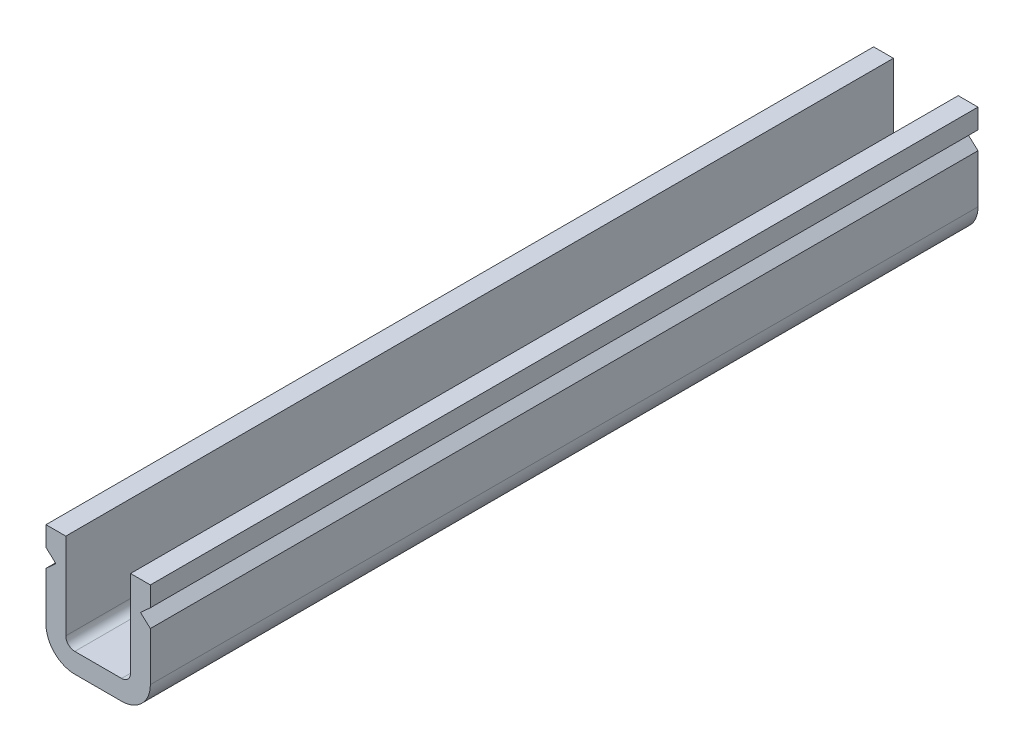
ISO-10303-21;
HEADER;
FILE_DESCRIPTION(('STEP AP214'),'2;1');
FILE_NAME('part.step','',(''),(''),'','','');
FILE_SCHEMA(('AUTOMOTIVE_DESIGN { 1 0 10303 214 1 1 1 1 }'));
ENDSEC;
DATA;
#1=APPLICATION_CONTEXT('core data for automotive mechanical design processes');
#2=APPLICATION_PROTOCOL_DEFINITION('international standard','automotive_design',2000,#1);
#3=PRODUCT_CONTEXT('',#1,'mechanical');
#4=PRODUCT('Part','Part','',(#3));
#5=PRODUCT_RELATED_PRODUCT_CATEGORY('part','',(#4));
#6=PRODUCT_DEFINITION_FORMATION('','',#4);
#7=PRODUCT_DEFINITION_CONTEXT('part definition',#1,'design');
#8=PRODUCT_DEFINITION('design','',#6,#7);
#9=PRODUCT_DEFINITION_SHAPE('','',#8);
#10=(LENGTH_UNIT() NAMED_UNIT(*) SI_UNIT(.MILLI.,.METRE.));
#11=(NAMED_UNIT(*) PLANE_ANGLE_UNIT() SI_UNIT($,.RADIAN.));
#12=(NAMED_UNIT(*) SI_UNIT($,.STERADIAN.) SOLID_ANGLE_UNIT());
#13=UNCERTAINTY_MEASURE_WITH_UNIT(LENGTH_MEASURE(1.E-05),#10,'distance_accuracy_value','');
#14=(GEOMETRIC_REPRESENTATION_CONTEXT(3) GLOBAL_UNCERTAINTY_ASSIGNED_CONTEXT((#13)) GLOBAL_UNIT_ASSIGNED_CONTEXT((#10,
#11,#12)) REPRESENTATION_CONTEXT('',''));
#15=CARTESIAN_POINT('',(0.,0.,0.));
#16=DIRECTION('',(0.,0.,1.));
#17=DIRECTION('',(1.,0.,0.));
#18=AXIS2_PLACEMENT_3D('',#15,#16,#17);
#19=CARTESIAN_POINT('',(1.09999999999999,0.,46.));
#20=DIRECTION('',(0.,-1.,0.));
#21=DIRECTION('',(1.,0.,0.));
#22=AXIS2_PLACEMENT_3D('',#19,#20,#21);
#23=PLANE('',#22);
#24=DIRECTION('',(-1.,0.,0.));
#25=VECTOR('',#24,1.);
#26=CARTESIAN_POINT('',(1.09999999999999,0.,0.));
#27=LINE('',#26,#25);
#28=CARTESIAN_POINT('',(1.09999999999999,0.,0.));
#29=VERTEX_POINT('',#28);
#30=CARTESIAN_POINT('',(0.,0.,0.));
#31=VERTEX_POINT('',#30);
#32=EDGE_CURVE('E189',#29,#31,#27,.T.);
#33=ORIENTED_EDGE('',*,*,#32,.T.);
#34=DIRECTION('',(0.,0.,-1.));
#35=VECTOR('',#34,1.);
#36=CARTESIAN_POINT('',(0.,0.,46.));
#37=LINE('',#36,#35);
#38=CARTESIAN_POINT('',(0.,0.,46.));
#39=VERTEX_POINT('',#38);
#40=EDGE_CURVE('E11',#39,#31,#37,.T.);
#41=ORIENTED_EDGE('',*,*,#40,.F.);
#42=DIRECTION('',(-1.,0.,0.));
#43=VECTOR('',#42,1.);
#44=CARTESIAN_POINT('',(1.09999999999999,0.,46.));
#45=LINE('',#44,#43);
#46=CARTESIAN_POINT('',(1.09999999999999,0.,46.));
#47=VERTEX_POINT('',#46);
#48=EDGE_CURVE('E223',#47,#39,#45,.T.);
#49=ORIENTED_EDGE('',*,*,#48,.F.);
#50=DIRECTION('',(0.,0.,-1.));
#51=VECTOR('',#50,1.);
#52=CARTESIAN_POINT('',(1.09999999999999,0.,46.));
#53=LINE('',#52,#51);
#54=EDGE_CURVE('E185',#47,#29,#53,.T.);
#55=ORIENTED_EDGE('',*,*,#54,.T.);
#56=EDGE_LOOP('',(#33,#41,#49,#55));
#57=FACE_BOUND('',#56,.T.);
#58=ADVANCED_FACE('F33',(#57),#23,.F.);
#59=CARTESIAN_POINT('',(0.,0.,46.));
#60=DIRECTION('',(1.,0.,0.));
#61=DIRECTION('',(0.,0.,-1.));
#62=AXIS2_PLACEMENT_3D('',#59,#60,#61);
#63=PLANE('',#62);
#64=DIRECTION('',(0.,-1.,0.));
#65=VECTOR('',#64,1.);
#66=CARTESIAN_POINT('',(0.,0.,0.));
#67=LINE('',#66,#65);
#68=CARTESIAN_POINT('',(0.,-1.1,0.));
#69=VERTEX_POINT('',#68);
#70=EDGE_CURVE('E192',#31,#69,#67,.T.);
#71=ORIENTED_EDGE('',*,*,#70,.T.);
#72=DIRECTION('',(0.,0.,-1.));
#73=VECTOR('',#72,1.);
#74=CARTESIAN_POINT('',(0.,-1.1,46.));
#75=LINE('',#74,#73);
#76=CARTESIAN_POINT('',(0.,-1.1,46.));
#77=VERTEX_POINT('',#76);
#78=EDGE_CURVE('E41',#77,#69,#75,.T.);
#79=ORIENTED_EDGE('',*,*,#78,.F.);
#80=DIRECTION('',(0.,-1.,0.));
#81=VECTOR('',#80,1.);
#82=CARTESIAN_POINT('',(0.,0.,46.));
#83=LINE('',#82,#81);
#84=EDGE_CURVE('E122',#39,#77,#83,.T.);
#85=ORIENTED_EDGE('',*,*,#84,.F.);
#86=ORIENTED_EDGE('',*,*,#40,.T.);
#87=EDGE_LOOP('',(#71,#79,#85,#86));
#88=FACE_BOUND('',#87,.T.);
#89=ADVANCED_FACE('F331',(#88),#63,.F.);
#90=CARTESIAN_POINT('',(0.,-1.1,46.));
#91=DIRECTION('',(0.672672793996313,0.739940073395944,0.));
#92=DIRECTION('',(-0.739940073395944,0.672672793996313,0.));
#93=AXIS2_PLACEMENT_3D('',#90,#91,#92);
#94=PLANE('',#93);
#95=DIRECTION('',(0.739940073395943,-0.672672793996313,0.));
#96=VECTOR('',#95,1.);
#97=CARTESIAN_POINT('',(0.,-1.1,0.));
#98=LINE('',#97,#96);
#99=CARTESIAN_POINT('',(0.549999999999995,-1.6,0.));
#100=VERTEX_POINT('',#99);
#101=EDGE_CURVE('E194',#69,#100,#98,.T.);
#102=ORIENTED_EDGE('',*,*,#101,.T.);
#103=DIRECTION('',(0.,0.,-1.));
#104=VECTOR('',#103,1.);
#105=CARTESIAN_POINT('',(0.549999999999995,-1.6,46.));
#106=LINE('',#105,#104);
#107=CARTESIAN_POINT('',(0.549999999999995,-1.6,46.));
#108=VERTEX_POINT('',#107);
#109=EDGE_CURVE('E260',#108,#100,#106,.T.);
#110=ORIENTED_EDGE('',*,*,#109,.F.);
#111=DIRECTION('',(0.739940073395943,-0.672672793996313,0.));
#112=VECTOR('',#111,1.);
#113=CARTESIAN_POINT('',(0.,-1.1,46.));
#114=LINE('',#113,#112);
#115=EDGE_CURVE('E268',#77,#108,#114,.T.);
#116=ORIENTED_EDGE('',*,*,#115,.F.);
#117=ORIENTED_EDGE('',*,*,#78,.T.);
#118=EDGE_LOOP('',(#102,#110,#116,#117));
#119=FACE_BOUND('',#118,.T.);
#120=ADVANCED_FACE('F266',(#119),#94,.F.);
#121=CARTESIAN_POINT('',(0.,-2.1,46.));
#122=DIRECTION('',(0.672672793996316,-0.739940073395941,0.));
#123=DIRECTION('',(0.739940073395941,0.672672793996316,0.));
#124=AXIS2_PLACEMENT_3D('',#121,#122,#123);
#125=PLANE('',#124);
#126=DIRECTION('',(-0.739940073395941,-0.672672793996316,0.));
#127=VECTOR('',#126,1.);
#128=CARTESIAN_POINT('',(0.,-2.1,0.));
#129=LINE('',#128,#127);
#130=CARTESIAN_POINT('',(0.,-2.1,0.));
#131=VERTEX_POINT('',#130);
#132=EDGE_CURVE('E196',#100,#131,#129,.T.);
#133=ORIENTED_EDGE('',*,*,#132,.T.);
#134=DIRECTION('',(0.,0.,-1.));
#135=VECTOR('',#134,1.);
#136=CARTESIAN_POINT('',(0.,-2.1,46.));
#137=LINE('',#136,#135);
#138=CARTESIAN_POINT('',(0.,-2.1,46.));
#139=VERTEX_POINT('',#138);
#140=EDGE_CURVE('E257',#139,#131,#137,.T.);
#141=ORIENTED_EDGE('',*,*,#140,.F.);
#142=DIRECTION('',(-0.739940073395941,-0.672672793996316,0.));
#143=VECTOR('',#142,1.);
#144=CARTESIAN_POINT('',(0.,-2.1,46.));
#145=LINE('',#144,#143);
#146=EDGE_CURVE('E286',#108,#139,#145,.T.);
#147=ORIENTED_EDGE('',*,*,#146,.F.);
#148=ORIENTED_EDGE('',*,*,#109,.T.);
#149=EDGE_LOOP('',(#133,#141,#147,#148));
#150=FACE_BOUND('',#149,.T.);
#151=ADVANCED_FACE('F277',(#150),#125,.F.);
#152=CARTESIAN_POINT('',(0.,-2.1,46.));
#153=DIRECTION('',(1.,0.,0.));
#154=DIRECTION('',(0.,1.,0.));
#155=AXIS2_PLACEMENT_3D('',#152,#153,#154);
#156=PLANE('',#155);
#157=DIRECTION('',(0.,-1.,0.));
#158=VECTOR('',#157,1.);
#159=CARTESIAN_POINT('',(0.,-2.1,0.));
#160=LINE('',#159,#158);
#161=CARTESIAN_POINT('',(0.,-4.79999999999998,0.));
#162=VERTEX_POINT('',#161);
#163=EDGE_CURVE('E198',#131,#162,#160,.T.);
#164=ORIENTED_EDGE('',*,*,#163,.T.);
#165=DIRECTION('',(0.,0.,-1.));
#166=VECTOR('',#165,1.);
#167=CARTESIAN_POINT('',(0.,-4.79999999999998,46.));
#168=LINE('',#167,#166);
#169=CARTESIAN_POINT('',(0.,-4.79999999999998,46.));
#170=VERTEX_POINT('',#169);
#171=EDGE_CURVE('E254',#170,#162,#168,.T.);
#172=ORIENTED_EDGE('',*,*,#171,.F.);
#173=DIRECTION('',(0.,-1.,0.));
#174=VECTOR('',#173,1.);
#175=CARTESIAN_POINT('',(0.,-2.1,46.));
#176=LINE('',#175,#174);
#177=EDGE_CURVE('E283',#139,#170,#176,.T.);
#178=ORIENTED_EDGE('',*,*,#177,.F.);
#179=ORIENTED_EDGE('',*,*,#140,.T.);
#180=EDGE_LOOP('',(#164,#172,#178,#179));
#181=FACE_BOUND('',#180,.T.);
#182=ADVANCED_FACE('F281',(#181),#156,.F.);
#183=CARTESIAN_POINT('',(1.6,-4.79999999999998,46.));
#184=DIRECTION('',(0.,0.,-1.));
#185=DIRECTION('',(-1.,0.,0.));
#186=AXIS2_PLACEMENT_3D('',#183,#184,#185);
#187=CYLINDRICAL_SURFACE('',#186,1.6);
#188=CARTESIAN_POINT('',(1.6,-4.79999999999998,0.));
#189=DIRECTION('',(0.,0.,1.));
#190=DIRECTION('',(1.,0.,0.));
#191=AXIS2_PLACEMENT_3D('',#188,#189,#190);
#192=CIRCLE('',#191,1.6);
#193=CARTESIAN_POINT('',(1.6,-6.39999999999998,0.));
#194=VERTEX_POINT('',#193);
#195=EDGE_CURVE('E200',#162,#194,#192,.T.);
#196=ORIENTED_EDGE('',*,*,#195,.T.);
#197=DIRECTION('',(0.,0.,-1.));
#198=VECTOR('',#197,1.);
#199=CARTESIAN_POINT('',(1.6,-6.39999999999998,46.));
#200=LINE('',#199,#198);
#201=CARTESIAN_POINT('',(1.6,-6.39999999999998,46.));
#202=VERTEX_POINT('',#201);
#203=EDGE_CURVE('E251',#202,#194,#200,.T.);
#204=ORIENTED_EDGE('',*,*,#203,.F.);
#205=CARTESIAN_POINT('',(1.6,-4.79999999999998,46.));
#206=DIRECTION('',(0.,0.,1.));
#207=DIRECTION('',(1.,0.,0.));
#208=AXIS2_PLACEMENT_3D('',#205,#206,#207);
#209=CIRCLE('',#208,1.6);
#210=EDGE_CURVE('E285',#170,#202,#209,.T.);
#211=ORIENTED_EDGE('',*,*,#210,.F.);
#212=ORIENTED_EDGE('',*,*,#171,.T.);
#213=EDGE_LOOP('',(#196,#204,#211,#212));
#214=FACE_BOUND('',#213,.T.);
#215=ADVANCED_FACE('F344',(#214),#187,.T.);
#216=CARTESIAN_POINT('',(1.6,-6.39999999999998,46.));
#217=DIRECTION('',(0.,1.,0.));
#218=DIRECTION('',(0.,0.,1.));
#219=AXIS2_PLACEMENT_3D('',#216,#217,#218);
#220=PLANE('',#219);
#221=DIRECTION('',(1.,0.,0.));
#222=VECTOR('',#221,1.);
#223=CARTESIAN_POINT('',(1.6,-6.39999999999998,0.));
#224=LINE('',#223,#222);
#225=CARTESIAN_POINT('',(4.19999999999997,-6.39999999999998,0.));
#226=VERTEX_POINT('',#225);
#227=EDGE_CURVE('E202',#194,#226,#224,.T.);
#228=ORIENTED_EDGE('',*,*,#227,.T.);
#229=DIRECTION('',(0.,0.,-1.));
#230=VECTOR('',#229,1.);
#231=CARTESIAN_POINT('',(4.19999999999997,-6.39999999999998,46.));
#232=LINE('',#231,#230);
#233=CARTESIAN_POINT('',(4.19999999999997,-6.39999999999998,46.));
#234=VERTEX_POINT('',#233);
#235=EDGE_CURVE('E248',#234,#226,#232,.T.);
#236=ORIENTED_EDGE('',*,*,#235,.F.);
#237=DIRECTION('',(1.,0.,0.));
#238=VECTOR('',#237,1.);
#239=CARTESIAN_POINT('',(1.6,-6.39999999999998,46.));
#240=LINE('',#239,#238);
#241=EDGE_CURVE('E288',#202,#234,#240,.T.);
#242=ORIENTED_EDGE('',*,*,#241,.F.);
#243=ORIENTED_EDGE('',*,*,#203,.T.);
#244=EDGE_LOOP('',(#228,#236,#242,#243));
#245=FACE_BOUND('',#244,.T.);
#246=ADVANCED_FACE('F347',(#245),#220,.F.);
#247=CARTESIAN_POINT('',(4.19999999999997,-4.79999999999998,46.));
#248=DIRECTION('',(0.,0.,-1.));
#249=DIRECTION('',(-1.,0.,0.));
#250=AXIS2_PLACEMENT_3D('',#247,#248,#249);
#251=CYLINDRICAL_SURFACE('',#250,1.6);
#252=CARTESIAN_POINT('',(4.19999999999997,-4.79999999999998,0.));
#253=DIRECTION('',(0.,0.,1.));
#254=DIRECTION('',(1.,0.,0.));
#255=AXIS2_PLACEMENT_3D('',#252,#253,#254);
#256=CIRCLE('',#255,1.6);
#257=CARTESIAN_POINT('',(5.79999999999997,-4.79999999999998,0.));
#258=VERTEX_POINT('',#257);
#259=EDGE_CURVE('E204',#226,#258,#256,.T.);
#260=ORIENTED_EDGE('',*,*,#259,.T.);
#261=DIRECTION('',(0.,0.,-1.));
#262=VECTOR('',#261,1.);
#263=CARTESIAN_POINT('',(5.79999999999997,-4.79999999999998,46.));
#264=LINE('',#263,#262);
#265=CARTESIAN_POINT('',(5.79999999999997,-4.79999999999998,46.));
#266=VERTEX_POINT('',#265);
#267=EDGE_CURVE('E245',#266,#258,#264,.T.);
#268=ORIENTED_EDGE('',*,*,#267,.F.);
#269=CARTESIAN_POINT('',(4.19999999999997,-4.79999999999998,46.));
#270=DIRECTION('',(0.,0.,1.));
#271=DIRECTION('',(1.,0.,0.));
#272=AXIS2_PLACEMENT_3D('',#269,#270,#271);
#273=CIRCLE('',#272,1.6);
#274=EDGE_CURVE('E294',#234,#266,#273,.T.);
#275=ORIENTED_EDGE('',*,*,#274,.F.);
#276=ORIENTED_EDGE('',*,*,#235,.T.);
#277=EDGE_LOOP('',(#260,#268,#275,#276));
#278=FACE_BOUND('',#277,.T.);
#279=ADVANCED_FACE('F351',(#278),#251,.T.);
#280=CARTESIAN_POINT('',(5.79999999999998,-4.79999999999998,46.));
#281=DIRECTION('',(-1.,0.,0.));
#282=DIRECTION('',(0.,-1.,0.));
#283=AXIS2_PLACEMENT_3D('',#280,#281,#282);
#284=PLANE('',#283);
#285=DIRECTION('',(0.,1.,0.));
#286=VECTOR('',#285,1.);
#287=CARTESIAN_POINT('',(5.79999999999998,-4.79999999999998,0.));
#288=LINE('',#287,#286);
#289=CARTESIAN_POINT('',(5.79999999999997,-2.1,0.));
#290=VERTEX_POINT('',#289);
#291=EDGE_CURVE('E206',#258,#290,#288,.T.);
#292=ORIENTED_EDGE('',*,*,#291,.T.);
#293=DIRECTION('',(0.,0.,-1.));
#294=VECTOR('',#293,1.);
#295=CARTESIAN_POINT('',(5.79999999999997,-2.1,46.));
#296=LINE('',#295,#294);
#297=CARTESIAN_POINT('',(5.79999999999997,-2.1,46.));
#298=VERTEX_POINT('',#297);
#299=EDGE_CURVE('E242',#298,#290,#296,.T.);
#300=ORIENTED_EDGE('',*,*,#299,.F.);
#301=DIRECTION('',(0.,1.,0.));
#302=VECTOR('',#301,1.);
#303=CARTESIAN_POINT('',(5.79999999999998,-4.79999999999998,46.));
#304=LINE('',#303,#302);
#305=EDGE_CURVE('E296',#266,#298,#304,.T.);
#306=ORIENTED_EDGE('',*,*,#305,.F.);
#307=ORIENTED_EDGE('',*,*,#267,.T.);
#308=EDGE_LOOP('',(#292,#300,#306,#307));
#309=FACE_BOUND('',#308,.T.);
#310=ADVANCED_FACE('F355',(#309),#284,.F.);
#311=CARTESIAN_POINT('',(5.79999999999997,-2.1,46.));
#312=DIRECTION('',(-0.672672793996319,-0.739940073395937,0.));
#313=DIRECTION('',(0.739940073395937,-0.672672793996319,0.));
#314=AXIS2_PLACEMENT_3D('',#311,#312,#313);
#315=PLANE('',#314);
#316=DIRECTION('',(-0.739940073395937,0.672672793996319,0.));
#317=VECTOR('',#316,1.);
#318=CARTESIAN_POINT('',(5.79999999999997,-2.1,0.));
#319=LINE('',#318,#317);
#320=CARTESIAN_POINT('',(5.24999999999999,-1.6,0.));
#321=VERTEX_POINT('',#320);
#322=EDGE_CURVE('E208',#290,#321,#319,.T.);
#323=ORIENTED_EDGE('',*,*,#322,.T.);
#324=DIRECTION('',(0.,0.,-1.));
#325=VECTOR('',#324,1.);
#326=CARTESIAN_POINT('',(5.24999999999999,-1.6,46.));
#327=LINE('',#326,#325);
#328=CARTESIAN_POINT('',(5.24999999999999,-1.6,46.));
#329=VERTEX_POINT('',#328);
#330=EDGE_CURVE('E239',#329,#321,#327,.T.);
#331=ORIENTED_EDGE('',*,*,#330,.F.);
#332=DIRECTION('',(-0.739940073395937,0.672672793996319,0.));
#333=VECTOR('',#332,1.);
#334=CARTESIAN_POINT('',(5.79999999999997,-2.1,46.));
#335=LINE('',#334,#333);
#336=EDGE_CURVE('E298',#298,#329,#335,.T.);
#337=ORIENTED_EDGE('',*,*,#336,.F.);
#338=ORIENTED_EDGE('',*,*,#299,.T.);
#339=EDGE_LOOP('',(#323,#331,#337,#338));
#340=FACE_BOUND('',#339,.T.);
#341=ADVANCED_FACE('F359',(#340),#315,.F.);
#342=CARTESIAN_POINT('',(5.79999999999997,-1.1,46.));
#343=DIRECTION('',(-0.672672793996316,0.73994007339594,0.));
#344=DIRECTION('',(-0.73994007339594,-0.672672793996317,0.));
#345=AXIS2_PLACEMENT_3D('',#342,#343,#344);
#346=PLANE('',#345);
#347=DIRECTION('',(0.73994007339594,0.672672793996317,0.));
#348=VECTOR('',#347,1.);
#349=CARTESIAN_POINT('',(5.79999999999997,-1.1,0.));
#350=LINE('',#349,#348);
#351=CARTESIAN_POINT('',(5.79999999999997,-1.1,0.));
#352=VERTEX_POINT('',#351);
#353=EDGE_CURVE('E210',#321,#352,#350,.T.);
#354=ORIENTED_EDGE('',*,*,#353,.T.);
#355=DIRECTION('',(0.,0.,-1.));
#356=VECTOR('',#355,1.);
#357=CARTESIAN_POINT('',(5.79999999999997,-1.1,46.));
#358=LINE('',#357,#356);
#359=CARTESIAN_POINT('',(5.79999999999997,-1.1,46.));
#360=VERTEX_POINT('',#359);
#361=EDGE_CURVE('E236',#360,#352,#358,.T.);
#362=ORIENTED_EDGE('',*,*,#361,.F.);
#363=DIRECTION('',(0.73994007339594,0.672672793996317,0.));
#364=VECTOR('',#363,1.);
#365=CARTESIAN_POINT('',(5.79999999999997,-1.1,46.));
#366=LINE('',#365,#364);
#367=EDGE_CURVE('E300',#329,#360,#366,.T.);
#368=ORIENTED_EDGE('',*,*,#367,.F.);
#369=ORIENTED_EDGE('',*,*,#330,.T.);
#370=EDGE_LOOP('',(#354,#362,#368,#369));
#371=FACE_BOUND('',#370,.T.);
#372=ADVANCED_FACE('F363',(#371),#346,.F.);
#373=CARTESIAN_POINT('',(5.79999999999997,-1.1,46.));
#374=DIRECTION('',(-1.,0.,0.));
#375=DIRECTION('',(0.,0.,1.));
#376=AXIS2_PLACEMENT_3D('',#373,#374,#375);
#377=PLANE('',#376);
#378=DIRECTION('',(0.,1.,0.));
#379=VECTOR('',#378,1.);
#380=CARTESIAN_POINT('',(5.79999999999997,-1.1,0.));
#381=LINE('',#380,#379);
#382=CARTESIAN_POINT('',(5.79999999999997,0.,0.));
#383=VERTEX_POINT('',#382);
#384=EDGE_CURVE('E212',#352,#383,#381,.T.);
#385=ORIENTED_EDGE('',*,*,#384,.T.);
#386=DIRECTION('',(0.,0.,-1.));
#387=VECTOR('',#386,1.);
#388=CARTESIAN_POINT('',(5.79999999999997,0.,46.));
#389=LINE('',#388,#387);
#390=CARTESIAN_POINT('',(5.79999999999997,0.,46.));
#391=VERTEX_POINT('',#390);
#392=EDGE_CURVE('E233',#391,#383,#389,.T.);
#393=ORIENTED_EDGE('',*,*,#392,.F.);
#394=DIRECTION('',(0.,1.,0.));
#395=VECTOR('',#394,1.);
#396=CARTESIAN_POINT('',(5.79999999999997,-1.1,46.));
#397=LINE('',#396,#395);
#398=EDGE_CURVE('E302',#360,#391,#397,.T.);
#399=ORIENTED_EDGE('',*,*,#398,.F.);
#400=ORIENTED_EDGE('',*,*,#361,.T.);
#401=EDGE_LOOP('',(#385,#393,#399,#400));
#402=FACE_BOUND('',#401,.T.);
#403=ADVANCED_FACE('F367',(#402),#377,.F.);
#404=CARTESIAN_POINT('',(5.79999999999997,0.,46.));
#405=DIRECTION('',(0.,-1.,0.));
#406=DIRECTION('',(1.,0.,0.));
#407=AXIS2_PLACEMENT_3D('',#404,#405,#406);
#408=PLANE('',#407);
#409=DIRECTION('',(-1.,0.,0.));
#410=VECTOR('',#409,1.);
#411=CARTESIAN_POINT('',(5.79999999999997,0.,0.));
#412=LINE('',#411,#410);
#413=CARTESIAN_POINT('',(4.69999999999999,0.,0.));
#414=VERTEX_POINT('',#413);
#415=EDGE_CURVE('E214',#383,#414,#412,.T.);
#416=ORIENTED_EDGE('',*,*,#415,.T.);
#417=DIRECTION('',(0.,0.,-1.));
#418=VECTOR('',#417,1.);
#419=CARTESIAN_POINT('',(4.69999999999999,0.,46.));
#420=LINE('',#419,#418);
#421=CARTESIAN_POINT('',(4.69999999999999,0.,46.));
#422=VERTEX_POINT('',#421);
#423=EDGE_CURVE('E230',#422,#414,#420,.T.);
#424=ORIENTED_EDGE('',*,*,#423,.F.);
#425=DIRECTION('',(-1.,0.,0.));
#426=VECTOR('',#425,1.);
#427=CARTESIAN_POINT('',(5.79999999999997,0.,46.));
#428=LINE('',#427,#426);
#429=EDGE_CURVE('E304',#391,#422,#428,.T.);
#430=ORIENTED_EDGE('',*,*,#429,.F.);
#431=ORIENTED_EDGE('',*,*,#392,.T.);
#432=EDGE_LOOP('',(#416,#424,#430,#431));
#433=FACE_BOUND('',#432,.T.);
#434=ADVANCED_FACE('F371',(#433),#408,.F.);
#435=CARTESIAN_POINT('',(4.69999999999999,-4.8,46.));
#436=DIRECTION('',(1.,0.,0.));
#437=DIRECTION('',(0.,0.,-1.));
#438=AXIS2_PLACEMENT_3D('',#435,#436,#437);
#439=PLANE('',#438);
#440=DIRECTION('',(0.,-1.,0.));
#441=VECTOR('',#440,1.);
#442=CARTESIAN_POINT('',(4.69999999999999,-4.8,0.));
#443=LINE('',#442,#441);
#444=CARTESIAN_POINT('',(4.69999999999999,-4.8,0.));
#445=VERTEX_POINT('',#444);
#446=EDGE_CURVE('E216',#414,#445,#443,.T.);
#447=ORIENTED_EDGE('',*,*,#446,.T.);
#448=DIRECTION('',(0.,0.,-1.));
#449=VECTOR('',#448,1.);
#450=CARTESIAN_POINT('',(4.69999999999999,-4.8,46.));
#451=LINE('',#450,#449);
#452=CARTESIAN_POINT('',(4.69999999999999,-4.8,46.));
#453=VERTEX_POINT('',#452);
#454=EDGE_CURVE('E227',#453,#445,#451,.T.);
#455=ORIENTED_EDGE('',*,*,#454,.F.);
#456=DIRECTION('',(0.,-1.,0.));
#457=VECTOR('',#456,1.);
#458=CARTESIAN_POINT('',(4.69999999999999,-4.8,46.));
#459=LINE('',#458,#457);
#460=EDGE_CURVE('E306',#422,#453,#459,.T.);
#461=ORIENTED_EDGE('',*,*,#460,.F.);
#462=ORIENTED_EDGE('',*,*,#423,.T.);
#463=EDGE_LOOP('',(#447,#455,#461,#462));
#464=FACE_BOUND('',#463,.T.);
#465=ADVANCED_FACE('F312',(#464),#439,.F.);
#466=CARTESIAN_POINT('',(4.19999999999999,-4.8,46.));
#467=DIRECTION('',(0.,0.,-1.));
#468=DIRECTION('',(-1.,0.,0.));
#469=AXIS2_PLACEMENT_3D('',#466,#467,#468);
#470=CYLINDRICAL_SURFACE('',#469,0.5);
#471=CARTESIAN_POINT('',(4.19999999999999,-4.8,0.));
#472=DIRECTION('',(0.,0.,-1.));
#473=DIRECTION('',(-1.,0.,0.));
#474=AXIS2_PLACEMENT_3D('',#471,#472,#473);
#475=CIRCLE('',#474,0.5);
#476=CARTESIAN_POINT('',(4.19999999999999,-5.3,0.));
#477=VERTEX_POINT('',#476);
#478=EDGE_CURVE('E218',#445,#477,#475,.T.);
#479=ORIENTED_EDGE('',*,*,#478,.T.);
#480=DIRECTION('',(0.,0.,-1.));
#481=VECTOR('',#480,1.);
#482=CARTESIAN_POINT('',(4.19999999999999,-5.3,46.));
#483=LINE('',#482,#481);
#484=CARTESIAN_POINT('',(4.19999999999999,-5.3,46.));
#485=VERTEX_POINT('',#484);
#486=EDGE_CURVE('E180',#485,#477,#483,.T.);
#487=ORIENTED_EDGE('',*,*,#486,.F.);
#488=CARTESIAN_POINT('',(4.19999999999999,-4.8,46.));
#489=DIRECTION('',(0.,0.,-1.));
#490=DIRECTION('',(-1.,0.,0.));
#491=AXIS2_PLACEMENT_3D('',#488,#489,#490);
#492=CIRCLE('',#491,0.5);
#493=EDGE_CURVE('E171',#453,#485,#492,.T.);
#494=ORIENTED_EDGE('',*,*,#493,.F.);
#495=ORIENTED_EDGE('',*,*,#454,.T.);
#496=EDGE_LOOP('',(#479,#487,#494,#495));
#497=FACE_BOUND('',#496,.T.);
#498=ADVANCED_FACE('F316',(#497),#470,.F.);
#499=CARTESIAN_POINT('',(1.59999999999999,-5.3,46.));
#500=DIRECTION('',(0.,-1.,0.));
#501=DIRECTION('',(0.,0.,-1.));
#502=AXIS2_PLACEMENT_3D('',#499,#500,#501);
#503=PLANE('',#502);
#504=DIRECTION('',(-1.,0.,0.));
#505=VECTOR('',#504,1.);
#506=CARTESIAN_POINT('',(1.59999999999999,-5.3,0.));
#507=LINE('',#506,#505);
#508=CARTESIAN_POINT('',(1.59999999999999,-5.3,0.));
#509=VERTEX_POINT('',#508);
#510=EDGE_CURVE('E179',#477,#509,#507,.T.);
#511=ORIENTED_EDGE('',*,*,#510,.T.);
#512=DIRECTION('',(0.,0.,-1.));
#513=VECTOR('',#512,1.);
#514=CARTESIAN_POINT('',(1.59999999999999,-5.3,46.));
#515=LINE('',#514,#513);
#516=CARTESIAN_POINT('',(1.59999999999999,-5.3,46.));
#517=VERTEX_POINT('',#516);
#518=EDGE_CURVE('E176',#517,#509,#515,.T.);
#519=ORIENTED_EDGE('',*,*,#518,.F.);
#520=DIRECTION('',(-1.,0.,0.));
#521=VECTOR('',#520,1.);
#522=CARTESIAN_POINT('',(1.59999999999999,-5.3,46.));
#523=LINE('',#522,#521);
#524=EDGE_CURVE('E165',#485,#517,#523,.T.);
#525=ORIENTED_EDGE('',*,*,#524,.F.);
#526=ORIENTED_EDGE('',*,*,#486,.T.);
#527=EDGE_LOOP('',(#511,#519,#525,#526));
#528=FACE_BOUND('',#527,.T.);
#529=ADVANCED_FACE('F177',(#528),#503,.F.);
#530=CARTESIAN_POINT('',(1.59999999999999,-4.8,46.));
#531=DIRECTION('',(0.,0.,-1.));
#532=DIRECTION('',(-1.,0.,0.));
#533=AXIS2_PLACEMENT_3D('',#530,#531,#532);
#534=CYLINDRICAL_SURFACE('',#533,0.5);
#535=CARTESIAN_POINT('',(1.59999999999999,-4.8,0.));
#536=DIRECTION('',(0.,0.,-1.));
#537=DIRECTION('',(1.,0.,0.));
#538=AXIS2_PLACEMENT_3D('',#535,#536,#537);
#539=CIRCLE('',#538,0.5);
#540=CARTESIAN_POINT('',(1.09999999999999,-4.8,0.));
#541=VERTEX_POINT('',#540);
#542=EDGE_CURVE('E108',#509,#541,#539,.T.);
#543=ORIENTED_EDGE('',*,*,#542,.T.);
#544=DIRECTION('',(0.,0.,-1.));
#545=VECTOR('',#544,1.);
#546=CARTESIAN_POINT('',(1.09999999999999,-4.8,46.));
#547=LINE('',#546,#545);
#548=CARTESIAN_POINT('',(1.09999999999999,-4.8,46.));
#549=VERTEX_POINT('',#548);
#550=EDGE_CURVE('E181',#549,#541,#547,.T.);
#551=ORIENTED_EDGE('',*,*,#550,.F.);
#552=CARTESIAN_POINT('',(1.59999999999999,-4.8,46.));
#553=DIRECTION('',(0.,0.,-1.));
#554=DIRECTION('',(1.,0.,0.));
#555=AXIS2_PLACEMENT_3D('',#552,#553,#554);
#556=CIRCLE('',#555,0.5);
#557=EDGE_CURVE('E169',#517,#549,#556,.T.);
#558=ORIENTED_EDGE('',*,*,#557,.F.);
#559=ORIENTED_EDGE('',*,*,#518,.T.);
#560=EDGE_LOOP('',(#543,#551,#558,#559));
#561=FACE_BOUND('',#560,.T.);
#562=ADVANCED_FACE('F183',(#561),#534,.F.);
#563=CARTESIAN_POINT('',(1.09999999999999,0.,46.));
#564=DIRECTION('',(-1.,0.,0.));
#565=DIRECTION('',(0.,-1.,0.));
#566=AXIS2_PLACEMENT_3D('',#563,#564,#565);
#567=PLANE('',#566);
#568=DIRECTION('',(0.,1.,0.));
#569=VECTOR('',#568,1.);
#570=CARTESIAN_POINT('',(1.09999999999999,0.,0.));
#571=LINE('',#570,#569);
#572=EDGE_CURVE('E114',#541,#29,#571,.T.);
#573=ORIENTED_EDGE('',*,*,#572,.T.);
#574=ORIENTED_EDGE('',*,*,#54,.F.);
#575=DIRECTION('',(0.,1.,0.));
#576=VECTOR('',#575,1.);
#577=CARTESIAN_POINT('',(1.09999999999999,0.,46.));
#578=LINE('',#577,#576);
#579=EDGE_CURVE('E49',#549,#47,#578,.T.);
#580=ORIENTED_EDGE('',*,*,#579,.F.);
#581=ORIENTED_EDGE('',*,*,#550,.T.);
#582=EDGE_LOOP('',(#573,#574,#580,#581));
#583=FACE_BOUND('',#582,.T.);
#584=ADVANCED_FACE('F320',(#583),#567,.F.);
#585=CARTESIAN_POINT('',(1.6,-4.79999999999998,46.));
#586=DIRECTION('',(0.,0.,1.));
#587=DIRECTION('',(1.,0.,0.));
#588=AXIS2_PLACEMENT_3D('',#585,#586,#587);
#589=PLANE('',#588);
#590=ORIENTED_EDGE('',*,*,#48,.T.);
#591=ORIENTED_EDGE('',*,*,#84,.T.);
#592=ORIENTED_EDGE('',*,*,#115,.T.);
#593=ORIENTED_EDGE('',*,*,#146,.T.);
#594=ORIENTED_EDGE('',*,*,#177,.T.);
#595=ORIENTED_EDGE('',*,*,#210,.T.);
#596=ORIENTED_EDGE('',*,*,#241,.T.);
#597=ORIENTED_EDGE('',*,*,#274,.T.);
#598=ORIENTED_EDGE('',*,*,#305,.T.);
#599=ORIENTED_EDGE('',*,*,#336,.T.);
#600=ORIENTED_EDGE('',*,*,#367,.T.);
#601=ORIENTED_EDGE('',*,*,#398,.T.);
#602=ORIENTED_EDGE('',*,*,#429,.T.);
#603=ORIENTED_EDGE('',*,*,#460,.T.);
#604=ORIENTED_EDGE('',*,*,#493,.T.);
#605=ORIENTED_EDGE('',*,*,#524,.T.);
#606=ORIENTED_EDGE('',*,*,#557,.T.);
#607=ORIENTED_EDGE('',*,*,#579,.T.);
#608=EDGE_LOOP('',(#590,#591,#592,#593,#594,#595,#596,#597,#598,#599,#600,#601,#602,#603,#604,
#605,#606,#607));
#609=FACE_BOUND('',#608,.T.);
#610=ADVANCED_FACE('F167',(#609),#589,.T.);
#611=CARTESIAN_POINT('',(1.6,-4.79999999999998,0.));
#612=DIRECTION('',(0.,0.,1.));
#613=DIRECTION('',(1.,0.,0.));
#614=AXIS2_PLACEMENT_3D('',#611,#612,#613);
#615=PLANE('',#614);
#616=ORIENTED_EDGE('',*,*,#32,.F.);
#617=ORIENTED_EDGE('',*,*,#572,.F.);
#618=ORIENTED_EDGE('',*,*,#542,.F.);
#619=ORIENTED_EDGE('',*,*,#510,.F.);
#620=ORIENTED_EDGE('',*,*,#478,.F.);
#621=ORIENTED_EDGE('',*,*,#446,.F.);
#622=ORIENTED_EDGE('',*,*,#415,.F.);
#623=ORIENTED_EDGE('',*,*,#384,.F.);
#624=ORIENTED_EDGE('',*,*,#353,.F.);
#625=ORIENTED_EDGE('',*,*,#322,.F.);
#626=ORIENTED_EDGE('',*,*,#291,.F.);
#627=ORIENTED_EDGE('',*,*,#259,.F.);
#628=ORIENTED_EDGE('',*,*,#227,.F.);
#629=ORIENTED_EDGE('',*,*,#195,.F.);
#630=ORIENTED_EDGE('',*,*,#163,.F.);
#631=ORIENTED_EDGE('',*,*,#132,.F.);
#632=ORIENTED_EDGE('',*,*,#101,.F.);
#633=ORIENTED_EDGE('',*,*,#70,.F.);
#634=EDGE_LOOP('',(#616,#617,#618,#619,#620,#621,#622,#623,#624,#625,#626,#627,#628,#629,#630,
#631,#632,#633));
#635=FACE_BOUND('',#634,.T.);
#636=ADVANCED_FACE('F272',(#635),#615,.F.);
#637=CLOSED_SHELL('',(#58,#89,#120,#151,#182,#215,#246,#279,#310,#341,#372,#403,#434,#465,#498,
#529,#562,#584,#610,#636));
#638=MANIFOLD_SOLID_BREP('B2',#637);
#639=ADVANCED_BREP_SHAPE_REPRESENTATION('',(#18,#638),#14);
#640=SHAPE_DEFINITION_REPRESENTATION(#9,#639);
ENDSEC;
END-ISO-10303-21;
